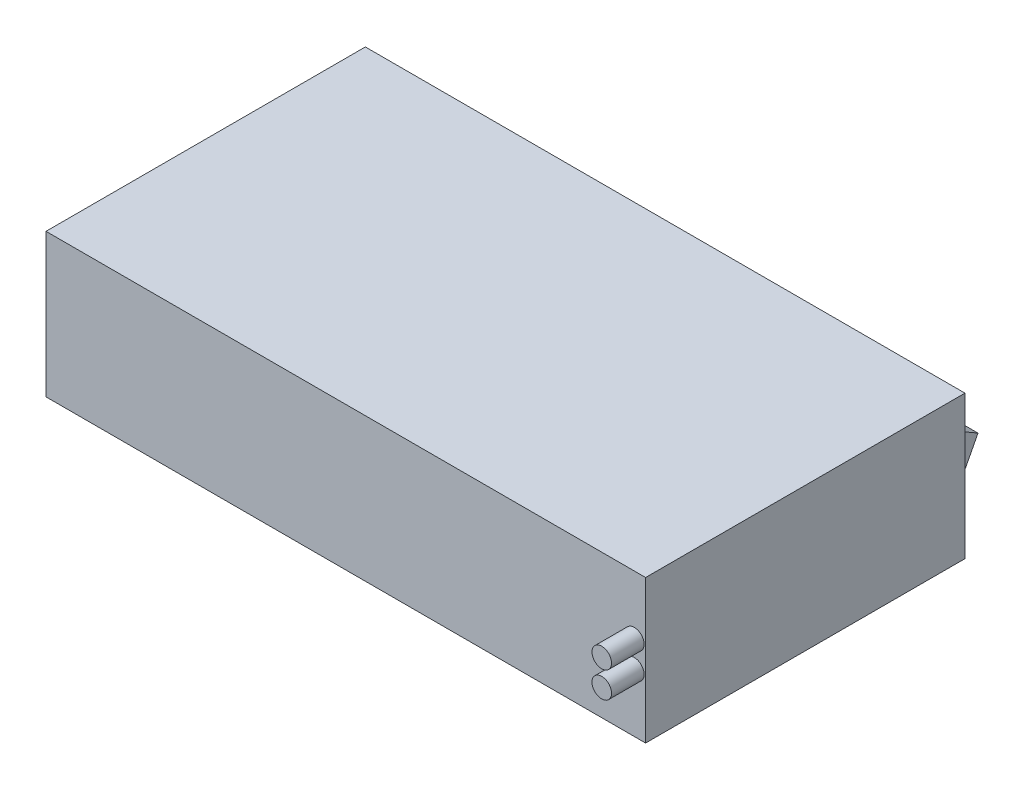
ISO-10303-21;
HEADER;
FILE_DESCRIPTION(('STEP AP214'),'2;1');
FILE_NAME('part.step','',(''),(''),'','','');
FILE_SCHEMA(('AUTOMOTIVE_DESIGN { 1 0 10303 214 1 1 1 1 }'));
ENDSEC;
DATA;
#1=APPLICATION_CONTEXT('core data for automotive mechanical design processes');
#2=APPLICATION_PROTOCOL_DEFINITION('international standard','automotive_design',2000,#1);
#3=PRODUCT_CONTEXT('',#1,'mechanical');
#4=PRODUCT('Part','Part','',(#3));
#5=PRODUCT_RELATED_PRODUCT_CATEGORY('part','',(#4));
#6=PRODUCT_DEFINITION_FORMATION('','',#4);
#7=PRODUCT_DEFINITION_CONTEXT('part definition',#1,'design');
#8=PRODUCT_DEFINITION('design','',#6,#7);
#9=PRODUCT_DEFINITION_SHAPE('','',#8);
#10=(LENGTH_UNIT() NAMED_UNIT(*) SI_UNIT(.MILLI.,.METRE.));
#11=(NAMED_UNIT(*) PLANE_ANGLE_UNIT() SI_UNIT($,.RADIAN.));
#12=(NAMED_UNIT(*) SI_UNIT($,.STERADIAN.) SOLID_ANGLE_UNIT());
#13=UNCERTAINTY_MEASURE_WITH_UNIT(LENGTH_MEASURE(1.E-05),#10,'distance_accuracy_value','');
#14=(GEOMETRIC_REPRESENTATION_CONTEXT(3) GLOBAL_UNCERTAINTY_ASSIGNED_CONTEXT((#13)) GLOBAL_UNIT_ASSIGNED_CONTEXT((#10,
#11,#12)) REPRESENTATION_CONTEXT('',''));
#15=CARTESIAN_POINT('',(0.,0.,0.));
#16=DIRECTION('',(0.,0.,1.));
#17=DIRECTION('',(1.,0.,0.));
#18=AXIS2_PLACEMENT_3D('',#15,#16,#17);
#19=CARTESIAN_POINT('',(42.4547803617571,16.,-38.7080103359173));
#20=DIRECTION('',(-1.,0.,0.));
#21=DIRECTION('',(0.,-1.,0.));
#22=AXIS2_PLACEMENT_3D('',#19,#20,#21);
#23=PLANE('',#22);
#24=DIRECTION('',(0.,0.88717484112584,-0.461433420195526));
#25=VECTOR('',#24,1.);
#26=CARTESIAN_POINT('',(42.4547803617571,-12.9309670080148,-24.8617202370776));
#27=LINE('',#26,#25);
#28=CARTESIAN_POINT('',(42.4547803617571,6.,-34.7080103359173));
#29=VERTEX_POINT('',#28);
#30=CARTESIAN_POINT('',(42.4547803617571,13.6905989232415,-38.7080103359173));
#31=VERTEX_POINT('',#30);
#32=EDGE_CURVE('E124',#29,#31,#27,.T.);
#33=ORIENTED_EDGE('',*,*,#32,.T.);
#34=DIRECTION('',(0.,0.500000000000001,0.866025403784438));
#35=VECTOR('',#34,1.);
#36=CARTESIAN_POINT('',(42.4547803617571,27.0290093328586,-15.6052058142548));
#37=LINE('',#36,#35);
#38=CARTESIAN_POINT('',(42.4547803617571,16.,-34.7080103359173));
#39=VERTEX_POINT('',#38);
#40=EDGE_CURVE('E148',#31,#39,#37,.T.);
#41=ORIENTED_EDGE('',*,*,#40,.T.);
#42=DIRECTION('',(0.,-1.,0.));
#43=VECTOR('',#42,1.);
#44=CARTESIAN_POINT('',(42.4547803617571,16.,-34.7080103359173));
#45=LINE('',#44,#43);
#46=EDGE_CURVE('E144',#39,#29,#45,.T.);
#47=ORIENTED_EDGE('',*,*,#46,.T.);
#48=EDGE_LOOP('',(#33,#41,#47));
#49=FACE_BOUND('',#48,.T.);
#50=ADVANCED_FACE('F54',(#49),#23,.F.);
#51=CARTESIAN_POINT('',(36.4547803617571,16.,-38.7080103359173));
#52=DIRECTION('',(1.,0.,0.));
#53=DIRECTION('',(0.,0.,-1.));
#54=AXIS2_PLACEMENT_3D('',#51,#52,#53);
#55=PLANE('',#54);
#56=DIRECTION('',(0.,0.88717484112584,-0.461433420195526));
#57=VECTOR('',#56,1.);
#58=CARTESIAN_POINT('',(36.4547803617571,15.5082804722751,-39.6534147535318));
#59=LINE('',#58,#57);
#60=CARTESIAN_POINT('',(36.4547803617571,6.,-34.7080103359173));
#61=VERTEX_POINT('',#60);
#62=CARTESIAN_POINT('',(36.4547803617571,13.6905989232415,-38.7080103359173));
#63=VERTEX_POINT('',#62);
#64=EDGE_CURVE('E135',#61,#63,#59,.T.);
#65=ORIENTED_EDGE('',*,*,#64,.F.);
#66=DIRECTION('',(0.,1.,0.));
#67=VECTOR('',#66,1.);
#68=CARTESIAN_POINT('',(36.4547803617571,16.,-34.7080103359173));
#69=LINE('',#68,#67);
#70=CARTESIAN_POINT('',(36.4547803617571,16.,-34.7080103359173));
#71=VERTEX_POINT('',#70);
#72=EDGE_CURVE('E146',#61,#71,#69,.T.);
#73=ORIENTED_EDGE('',*,*,#72,.T.);
#74=DIRECTION('',(0.,0.500000000000001,0.866025403784438));
#75=VECTOR('',#74,1.);
#76=CARTESIAN_POINT('',(36.4547803617571,14.2679491924311,-37.7080103359173));
#77=LINE('',#76,#75);
#78=EDGE_CURVE('E149',#63,#71,#77,.T.);
#79=ORIENTED_EDGE('',*,*,#78,.F.);
#80=EDGE_LOOP('',(#65,#73,#79));
#81=FACE_BOUND('',#80,.T.);
#82=ADVANCED_FACE('F207',(#81),#55,.F.);
#83=CARTESIAN_POINT('',(-47.5452196382429,22.,-34.7080103359173));
#84=DIRECTION('',(0.,0.,1.));
#85=DIRECTION('',(1.,0.,0.));
#86=AXIS2_PLACEMENT_3D('',#83,#84,#85);
#87=PLANE('',#86);
#88=CARTESIAN_POINT('',(34.4547803617571,11.,-34.7080103359173));
#89=DIRECTION('',(0.,0.,1.));
#90=DIRECTION('',(1.,0.,0.));
#91=AXIS2_PLACEMENT_3D('',#88,#89,#90);
#92=CIRCLE('',#91,0.999999999999997);
#93=CARTESIAN_POINT('',(35.454780361757,11.,-34.7080103359173));
#94=VERTEX_POINT('',#93);
#95=EDGE_CURVE('E136',#94,#94,#92,.T.);
#96=ORIENTED_EDGE('',*,*,#95,.T.);
#97=EDGE_LOOP('',(#96));
#98=FACE_BOUND('',#97,.T.);
#99=ORIENTED_EDGE('',*,*,#72,.F.);
#100=DIRECTION('',(-1.,0.,0.));
#101=VECTOR('',#100,1.);
#102=CARTESIAN_POINT('',(42.4547803617571,6.,-34.7080103359173));
#103=LINE('',#102,#101);
#104=EDGE_CURVE('E127',#29,#61,#103,.T.);
#105=ORIENTED_EDGE('',*,*,#104,.F.);
#106=ORIENTED_EDGE('',*,*,#46,.F.);
#107=DIRECTION('',(1.,0.,0.));
#108=VECTOR('',#107,1.);
#109=CARTESIAN_POINT('',(42.4547803617571,16.,-34.7080103359173));
#110=LINE('',#109,#108);
#111=EDGE_CURVE('E155',#71,#39,#110,.T.);
#112=ORIENTED_EDGE('',*,*,#111,.F.);
#113=EDGE_LOOP('',(#99,#105,#106,#112));
#114=FACE_BOUND('',#113,.T.);
#115=DIRECTION('',(-1.,0.,0.));
#116=VECTOR('',#115,1.);
#117=CARTESIAN_POINT('',(-47.5452196382429,0.,-34.7080103359173));
#118=LINE('',#117,#116);
#119=CARTESIAN_POINT('',(44.4547803617571,0.,-34.7080103359173));
#120=VERTEX_POINT('',#119);
#121=CARTESIAN_POINT('',(-47.5452196382429,0.,-34.7080103359173));
#122=VERTEX_POINT('',#121);
#123=EDGE_CURVE('E160',#120,#122,#118,.T.);
#124=ORIENTED_EDGE('',*,*,#123,.T.);
#125=DIRECTION('',(0.,-1.,0.));
#126=VECTOR('',#125,1.);
#127=CARTESIAN_POINT('',(-47.5452196382429,22.,-34.7080103359173));
#128=LINE('',#127,#126);
#129=CARTESIAN_POINT('',(-47.5452196382429,22.,-34.7080103359173));
#130=VERTEX_POINT('',#129);
#131=EDGE_CURVE('E96',#130,#122,#128,.T.);
#132=ORIENTED_EDGE('',*,*,#131,.F.);
#133=DIRECTION('',(-1.,0.,0.));
#134=VECTOR('',#133,1.);
#135=CARTESIAN_POINT('',(-47.5452196382429,22.,-34.7080103359173));
#136=LINE('',#135,#134);
#137=CARTESIAN_POINT('',(44.4547803617571,22.,-34.7080103359173));
#138=VERTEX_POINT('',#137);
#139=EDGE_CURVE('E71',#138,#130,#136,.T.);
#140=ORIENTED_EDGE('',*,*,#139,.F.);
#141=DIRECTION('',(0.,-1.,0.));
#142=VECTOR('',#141,1.);
#143=CARTESIAN_POINT('',(44.4547803617571,22.,-34.7080103359173));
#144=LINE('',#143,#142);
#145=EDGE_CURVE('E171',#138,#120,#144,.T.);
#146=ORIENTED_EDGE('',*,*,#145,.T.);
#147=EDGE_LOOP('',(#124,#132,#140,#146));
#148=FACE_BOUND('',#147,.T.);
#149=ADVANCED_FACE('F141',(#98,#114,#148),#87,.F.);
#150=CARTESIAN_POINT('',(-47.5452196382429,22.,-34.7080103359173));
#151=DIRECTION('',(1.,0.,0.));
#152=DIRECTION('',(0.,0.,-1.));
#153=AXIS2_PLACEMENT_3D('',#150,#151,#152);
#154=PLANE('',#153);
#155=DIRECTION('',(0.,0.,1.));
#156=VECTOR('',#155,1.);
#157=CARTESIAN_POINT('',(-47.5452196382429,0.,-34.7080103359173));
#158=LINE('',#157,#156);
#159=CARTESIAN_POINT('',(-47.5452196382429,0.,14.2919896640827));
#160=VERTEX_POINT('',#159);
#161=EDGE_CURVE('E157',#122,#160,#158,.T.);
#162=ORIENTED_EDGE('',*,*,#161,.T.);
#163=DIRECTION('',(0.,-1.,0.));
#164=VECTOR('',#163,1.);
#165=CARTESIAN_POINT('',(-47.5452196382429,22.,14.2919896640827));
#166=LINE('',#165,#164);
#167=CARTESIAN_POINT('',(-47.5452196382429,22.,14.2919896640827));
#168=VERTEX_POINT('',#167);
#169=EDGE_CURVE('E175',#168,#160,#166,.T.);
#170=ORIENTED_EDGE('',*,*,#169,.F.);
#171=DIRECTION('',(0.,0.,1.));
#172=VECTOR('',#171,1.);
#173=CARTESIAN_POINT('',(-47.5452196382429,22.,-34.7080103359173));
#174=LINE('',#173,#172);
#175=EDGE_CURVE('E158',#130,#168,#174,.T.);
#176=ORIENTED_EDGE('',*,*,#175,.F.);
#177=ORIENTED_EDGE('',*,*,#131,.T.);
#178=EDGE_LOOP('',(#162,#170,#176,#177));
#179=FACE_BOUND('',#178,.T.);
#180=ADVANCED_FACE('F56',(#179),#154,.F.);
#181=CARTESIAN_POINT('',(-47.5452196382429,22.,14.2919896640827));
#182=DIRECTION('',(0.,0.,-1.));
#183=DIRECTION('',(-1.,0.,0.));
#184=AXIS2_PLACEMENT_3D('',#181,#182,#183);
#185=PLANE('',#184);
#186=CARTESIAN_POINT('',(42.7265827196706,9.,14.2919896640827));
#187=DIRECTION('',(0.,0.,-1.));
#188=DIRECTION('',(-1.,0.,0.));
#189=AXIS2_PLACEMENT_3D('',#186,#187,#188);
#190=CIRCLE('',#189,1.5);
#191=CARTESIAN_POINT('',(41.2265827196706,9.,14.2919896640827));
#192=VERTEX_POINT('',#191);
#193=EDGE_CURVE('E12',#192,#192,#190,.F.);
#194=ORIENTED_EDGE('',*,*,#193,.F.);
#195=EDGE_LOOP('',(#194));
#196=FACE_BOUND('',#195,.T.);
#197=CARTESIAN_POINT('',(42.7265827196706,13.,14.2919896640827));
#198=DIRECTION('',(0.,0.,-1.));
#199=DIRECTION('',(-1.,0.,0.));
#200=AXIS2_PLACEMENT_3D('',#197,#198,#199);
#201=CIRCLE('',#200,1.5);
#202=CARTESIAN_POINT('',(41.2265827196706,13.,14.2919896640827));
#203=VERTEX_POINT('',#202);
#204=EDGE_CURVE('E63',#203,#203,#201,.F.);
#205=ORIENTED_EDGE('',*,*,#204,.F.);
#206=EDGE_LOOP('',(#205));
#207=FACE_BOUND('',#206,.T.);
#208=DIRECTION('',(1.,0.,0.));
#209=VECTOR('',#208,1.);
#210=CARTESIAN_POINT('',(-47.5452196382429,0.,14.2919896640827));
#211=LINE('',#210,#209);
#212=CARTESIAN_POINT('',(44.4547803617571,0.,14.2919896640827));
#213=VERTEX_POINT('',#212);
#214=EDGE_CURVE('E166',#160,#213,#211,.T.);
#215=ORIENTED_EDGE('',*,*,#214,.T.);
#216=DIRECTION('',(0.,-1.,0.));
#217=VECTOR('',#216,1.);
#218=CARTESIAN_POINT('',(44.4547803617571,22.,14.2919896640827));
#219=LINE('',#218,#217);
#220=CARTESIAN_POINT('',(44.4547803617571,22.,14.2919896640827));
#221=VERTEX_POINT('',#220);
#222=EDGE_CURVE('E173',#221,#213,#219,.T.);
#223=ORIENTED_EDGE('',*,*,#222,.F.);
#224=DIRECTION('',(1.,0.,0.));
#225=VECTOR('',#224,1.);
#226=CARTESIAN_POINT('',(-47.5452196382429,22.,14.2919896640827));
#227=LINE('',#226,#225);
#228=EDGE_CURVE('E104',#168,#221,#227,.T.);
#229=ORIENTED_EDGE('',*,*,#228,.F.);
#230=ORIENTED_EDGE('',*,*,#169,.T.);
#231=EDGE_LOOP('',(#215,#223,#229,#230));
#232=FACE_BOUND('',#231,.T.);
#233=ADVANCED_FACE('F185',(#196,#207,#232),#185,.F.);
#234=CARTESIAN_POINT('',(44.4547803617571,22.,-34.7080103359173));
#235=DIRECTION('',(-1.,0.,0.));
#236=DIRECTION('',(0.,0.,1.));
#237=AXIS2_PLACEMENT_3D('',#234,#235,#236);
#238=PLANE('',#237);
#239=DIRECTION('',(0.,0.,-1.));
#240=VECTOR('',#239,1.);
#241=CARTESIAN_POINT('',(44.4547803617571,0.,-34.7080103359173));
#242=LINE('',#241,#240);
#243=EDGE_CURVE('E89',#213,#120,#242,.T.);
#244=ORIENTED_EDGE('',*,*,#243,.T.);
#245=ORIENTED_EDGE('',*,*,#145,.F.);
#246=DIRECTION('',(0.,0.,-1.));
#247=VECTOR('',#246,1.);
#248=CARTESIAN_POINT('',(44.4547803617571,22.,-34.7080103359173));
#249=LINE('',#248,#247);
#250=EDGE_CURVE('E162',#221,#138,#249,.T.);
#251=ORIENTED_EDGE('',*,*,#250,.F.);
#252=ORIENTED_EDGE('',*,*,#222,.T.);
#253=EDGE_LOOP('',(#244,#245,#251,#252));
#254=FACE_BOUND('',#253,.T.);
#255=ADVANCED_FACE('F187',(#254),#238,.F.);
#256=CARTESIAN_POINT('',(0.,22.,0.));
#257=DIRECTION('',(0.,1.,0.));
#258=DIRECTION('',(0.,0.,1.));
#259=AXIS2_PLACEMENT_3D('',#256,#257,#258);
#260=PLANE('',#259);
#261=ORIENTED_EDGE('',*,*,#175,.T.);
#262=ORIENTED_EDGE('',*,*,#228,.T.);
#263=ORIENTED_EDGE('',*,*,#250,.T.);
#264=ORIENTED_EDGE('',*,*,#139,.T.);
#265=EDGE_LOOP('',(#261,#262,#263,#264));
#266=FACE_BOUND('',#265,.T.);
#267=ADVANCED_FACE('F195',(#266),#260,.T.);
#268=CARTESIAN_POINT('',(0.,0.,0.));
#269=DIRECTION('',(0.,1.,0.));
#270=DIRECTION('',(0.,0.,1.));
#271=AXIS2_PLACEMENT_3D('',#268,#269,#270);
#272=PLANE('',#271);
#273=ORIENTED_EDGE('',*,*,#161,.F.);
#274=ORIENTED_EDGE('',*,*,#123,.F.);
#275=ORIENTED_EDGE('',*,*,#243,.F.);
#276=ORIENTED_EDGE('',*,*,#214,.F.);
#277=EDGE_LOOP('',(#273,#274,#275,#276));
#278=FACE_BOUND('',#277,.T.);
#279=ADVANCED_FACE('F194',(#278),#272,.F.);
#280=CARTESIAN_POINT('',(-47.5452196382429,27.0290093328586,-15.6052058142548));
#281=DIRECTION('',(0.,0.866025403784438,-0.500000000000001));
#282=DIRECTION('',(0.,0.500000000000001,0.866025403784438));
#283=AXIS2_PLACEMENT_3D('',#280,#281,#282);
#284=PLANE('',#283);
#285=ORIENTED_EDGE('',*,*,#78,.T.);
#286=ORIENTED_EDGE('',*,*,#111,.T.);
#287=ORIENTED_EDGE('',*,*,#40,.F.);
#288=DIRECTION('',(1.,0.,0.));
#289=VECTOR('',#288,1.);
#290=CARTESIAN_POINT('',(0.,13.6905989232415,-38.7080103359173));
#291=LINE('',#290,#289);
#292=EDGE_CURVE('E130',#63,#31,#291,.T.);
#293=ORIENTED_EDGE('',*,*,#292,.F.);
#294=EDGE_LOOP('',(#285,#286,#287,#293));
#295=FACE_BOUND('',#294,.T.);
#296=ADVANCED_FACE('F202',(#295),#284,.T.);
#297=CARTESIAN_POINT('',(-47.5452196382429,-12.9309670080149,-24.8617202370776));
#298=DIRECTION('',(0.,-0.461433420195526,-0.88717484112584));
#299=DIRECTION('',(0.,0.88717484112584,-0.461433420195526));
#300=AXIS2_PLACEMENT_3D('',#297,#298,#299);
#301=PLANE('',#300);
#302=ORIENTED_EDGE('',*,*,#64,.T.);
#303=ORIENTED_EDGE('',*,*,#292,.T.);
#304=ORIENTED_EDGE('',*,*,#32,.F.);
#305=ORIENTED_EDGE('',*,*,#104,.T.);
#306=EDGE_LOOP('',(#302,#303,#304,#305));
#307=FACE_BOUND('',#306,.T.);
#308=ADVANCED_FACE('F126',(#307),#301,.T.);
#309=CARTESIAN_POINT('',(34.4547803617571,11.,-34.7080103359173));
#310=DIRECTION('',(0.,-1.,0.));
#311=DIRECTION('',(1.,0.,0.));
#312=AXIS2_PLACEMENT_3D('',#309,#310,#311);
#313=SPHERICAL_SURFACE('',#312,0.999999999999997);
#314=CARTESIAN_POINT('',(34.4547803617571,11.,-34.7080103359173));
#315=DIRECTION('',(0.,0.,1.));
#316=DIRECTION('',(1.,0.,0.));
#317=AXIS2_PLACEMENT_3D('',#314,#315,#316);
#318=SPHERICAL_SURFACE('',#317,0.999999999999997);
#319=ORIENTED_EDGE('',*,*,#95,.F.);
#320=EDGE_LOOP('',(#319));
#321=FACE_BOUND('',#320,.T.);
#322=ADVANCED_FACE('F219',(#321),#318,.T.);
#323=CARTESIAN_POINT('',(42.7265827196706,13.,19.2919896640827));
#324=DIRECTION('',(0.,0.,-1.));
#325=DIRECTION('',(-1.,0.,0.));
#326=AXIS2_PLACEMENT_3D('',#323,#324,#325);
#327=CYLINDRICAL_SURFACE('',#326,1.5);
#328=CARTESIAN_POINT('',(42.7265827196706,13.,19.2919896640827));
#329=DIRECTION('',(0.,0.,1.));
#330=DIRECTION('',(1.,0.,0.));
#331=AXIS2_PLACEMENT_3D('',#328,#329,#330);
#332=CIRCLE('',#331,1.5);
#333=CARTESIAN_POINT('',(44.2265827196706,13.,19.2919896640827));
#334=VERTEX_POINT('',#333);
#335=EDGE_CURVE('E179',#334,#334,#332,.T.);
#336=ORIENTED_EDGE('',*,*,#335,.F.);
#337=EDGE_LOOP('',(#336));
#338=FACE_BOUND('',#337,.T.);
#339=ORIENTED_EDGE('',*,*,#204,.T.);
#340=EDGE_LOOP('',(#339));
#341=FACE_BOUND('',#340,.T.);
#342=ADVANCED_FACE('F183',(#338,#341),#327,.T.);
#343=CARTESIAN_POINT('',(42.7265827196706,13.,19.2919896640827));
#344=DIRECTION('',(0.,0.,1.));
#345=DIRECTION('',(1.,0.,0.));
#346=AXIS2_PLACEMENT_3D('',#343,#344,#345);
#347=PLANE('',#346);
#348=ORIENTED_EDGE('',*,*,#335,.T.);
#349=EDGE_LOOP('',(#348));
#350=FACE_BOUND('',#349,.T.);
#351=ADVANCED_FACE('F225',(#350),#347,.T.);
#352=CARTESIAN_POINT('',(42.7265827196706,9.,19.2919896640827));
#353=DIRECTION('',(0.,0.,-1.));
#354=DIRECTION('',(-1.,0.,0.));
#355=AXIS2_PLACEMENT_3D('',#352,#353,#354);
#356=CYLINDRICAL_SURFACE('',#355,1.5);
#357=CARTESIAN_POINT('',(42.7265827196706,9.,19.2919896640827));
#358=DIRECTION('',(0.,0.,1.));
#359=DIRECTION('',(1.,0.,0.));
#360=AXIS2_PLACEMENT_3D('',#357,#358,#359);
#361=CIRCLE('',#360,1.5);
#362=CARTESIAN_POINT('',(44.2265827196706,9.,19.2919896640827));
#363=VERTEX_POINT('',#362);
#364=EDGE_CURVE('E241',#363,#363,#361,.T.);
#365=ORIENTED_EDGE('',*,*,#364,.F.);
#366=EDGE_LOOP('',(#365));
#367=FACE_BOUND('',#366,.T.);
#368=ORIENTED_EDGE('',*,*,#193,.T.);
#369=EDGE_LOOP('',(#368));
#370=FACE_BOUND('',#369,.T.);
#371=ADVANCED_FACE('F229',(#367,#370),#356,.T.);
#372=CARTESIAN_POINT('',(42.7265827196706,9.,19.2919896640827));
#373=DIRECTION('',(0.,0.,1.));
#374=DIRECTION('',(1.,0.,0.));
#375=AXIS2_PLACEMENT_3D('',#372,#373,#374);
#376=PLANE('',#375);
#377=ORIENTED_EDGE('',*,*,#364,.T.);
#378=EDGE_LOOP('',(#377));
#379=FACE_BOUND('',#378,.T.);
#380=ADVANCED_FACE('F233',(#379),#376,.T.);
#381=CLOSED_SHELL('',(#50,#82,#149,#180,#233,#255,#267,#279,#296,#308,#322,#342,#351,#371,#380));
#382=MANIFOLD_SOLID_BREP('B2',#381);
#383=ADVANCED_BREP_SHAPE_REPRESENTATION('',(#18,#382),#14);
#384=SHAPE_DEFINITION_REPRESENTATION(#9,#383);
ENDSEC;
END-ISO-10303-21;
